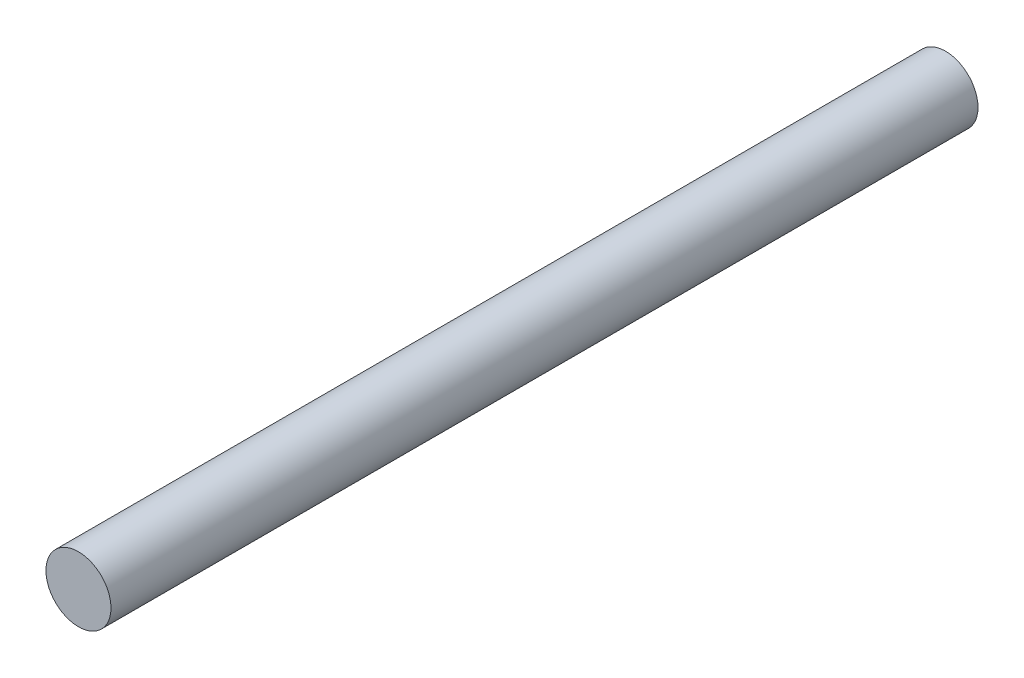
ISO-10303-21;
HEADER;
FILE_DESCRIPTION(('STEP AP214'),'2;1');
FILE_NAME('part.step','',(''),(''),'','','');
FILE_SCHEMA(('AUTOMOTIVE_DESIGN { 1 0 10303 214 1 1 1 1 }'));
ENDSEC;
DATA;
#1=APPLICATION_CONTEXT('core data for automotive mechanical design processes');
#2=APPLICATION_PROTOCOL_DEFINITION('international standard','automotive_design',2000,#1);
#3=PRODUCT_CONTEXT('',#1,'mechanical');
#4=PRODUCT('Part','Part','',(#3));
#5=PRODUCT_RELATED_PRODUCT_CATEGORY('part','',(#4));
#6=PRODUCT_DEFINITION_FORMATION('','',#4);
#7=PRODUCT_DEFINITION_CONTEXT('part definition',#1,'design');
#8=PRODUCT_DEFINITION('design','',#6,#7);
#9=PRODUCT_DEFINITION_SHAPE('','',#8);
#10=(LENGTH_UNIT() NAMED_UNIT(*) SI_UNIT(.MILLI.,.METRE.));
#11=(NAMED_UNIT(*) PLANE_ANGLE_UNIT() SI_UNIT($,.RADIAN.));
#12=(NAMED_UNIT(*) SI_UNIT($,.STERADIAN.) SOLID_ANGLE_UNIT());
#13=UNCERTAINTY_MEASURE_WITH_UNIT(LENGTH_MEASURE(1.E-05),#10,'distance_accuracy_value','');
#14=(GEOMETRIC_REPRESENTATION_CONTEXT(3) GLOBAL_UNCERTAINTY_ASSIGNED_CONTEXT((#13)) GLOBAL_UNIT_ASSIGNED_CONTEXT((#10,
#11,#12)) REPRESENTATION_CONTEXT('',''));
#15=CARTESIAN_POINT('',(0.,0.,0.));
#16=DIRECTION('',(0.,0.,1.));
#17=DIRECTION('',(1.,0.,0.));
#18=AXIS2_PLACEMENT_3D('',#15,#16,#17);
#19=CARTESIAN_POINT('',(0.,0.,80.));
#20=DIRECTION('',(0.,0.,-1.));
#21=DIRECTION('',(-1.,0.,0.));
#22=AXIS2_PLACEMENT_3D('',#19,#20,#21);
#23=CYLINDRICAL_SURFACE('',#22,3.);
#24=CARTESIAN_POINT('',(0.,0.,80.));
#25=DIRECTION('',(0.,0.,1.));
#26=DIRECTION('',(1.,0.,0.));
#27=AXIS2_PLACEMENT_3D('',#24,#25,#26);
#28=CIRCLE('',#27,3.);
#29=CARTESIAN_POINT('',(3.,0.,80.));
#30=VERTEX_POINT('',#29);
#31=EDGE_CURVE('E10',#30,#30,#28,.T.);
#32=ORIENTED_EDGE('',*,*,#31,.F.);
#33=EDGE_LOOP('',(#32));
#34=FACE_BOUND('',#33,.T.);
#35=CARTESIAN_POINT('',(0.,0.,0.));
#36=DIRECTION('',(0.,0.,1.));
#37=DIRECTION('',(1.,0.,0.));
#38=AXIS2_PLACEMENT_3D('',#35,#36,#37);
#39=CIRCLE('',#38,3.);
#40=CARTESIAN_POINT('',(3.,0.,0.));
#41=VERTEX_POINT('',#40);
#42=EDGE_CURVE('E44',#41,#41,#39,.T.);
#43=ORIENTED_EDGE('',*,*,#42,.T.);
#44=EDGE_LOOP('',(#43));
#45=FACE_BOUND('',#44,.T.);
#46=ADVANCED_FACE('F41',(#34,#45),#23,.T.);
#47=CARTESIAN_POINT('',(0.,0.,80.));
#48=DIRECTION('',(0.,0.,1.));
#49=DIRECTION('',(1.,0.,0.));
#50=AXIS2_PLACEMENT_3D('',#47,#48,#49);
#51=PLANE('',#50);
#52=ORIENTED_EDGE('',*,*,#31,.T.);
#53=EDGE_LOOP('',(#52));
#54=FACE_BOUND('',#53,.T.);
#55=ADVANCED_FACE('F58',(#54),#51,.T.);
#56=CARTESIAN_POINT('',(0.,0.,0.));
#57=DIRECTION('',(0.,0.,1.));
#58=DIRECTION('',(1.,0.,0.));
#59=AXIS2_PLACEMENT_3D('',#56,#57,#58);
#60=PLANE('',#59);
#61=ORIENTED_EDGE('',*,*,#42,.F.);
#62=EDGE_LOOP('',(#61));
#63=FACE_BOUND('',#62,.T.);
#64=ADVANCED_FACE('F56',(#63),#60,.F.);
#65=CLOSED_SHELL('',(#46,#55,#64));
#66=MANIFOLD_SOLID_BREP('B2',#65);
#67=ADVANCED_BREP_SHAPE_REPRESENTATION('',(#18,#66),#14);
#68=SHAPE_DEFINITION_REPRESENTATION(#9,#67);
ENDSEC;
END-ISO-10303-21;
